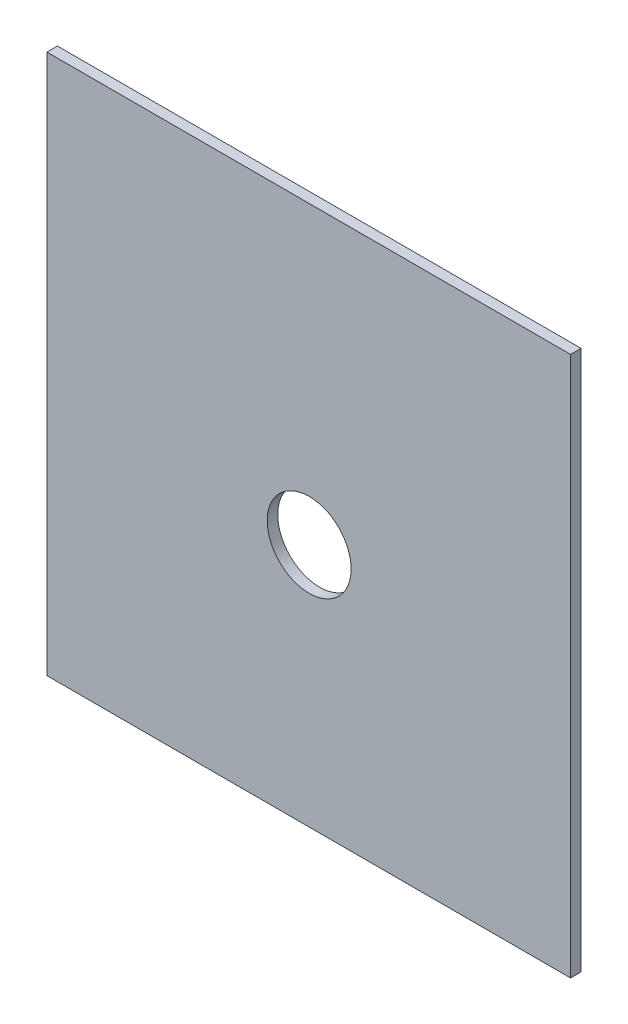
ISO-10303-21;
HEADER;
FILE_DESCRIPTION(('STEP AP214'),'2;1');
FILE_NAME('part.step','',(''),(''),'','','');
FILE_SCHEMA(('AUTOMOTIVE_DESIGN { 1 0 10303 214 1 1 1 1 }'));
ENDSEC;
DATA;
#1=APPLICATION_CONTEXT('core data for automotive mechanical design processes');
#2=APPLICATION_PROTOCOL_DEFINITION('international standard','automotive_design',2000,#1);
#3=PRODUCT_CONTEXT('',#1,'mechanical');
#4=PRODUCT('Part','Part','',(#3));
#5=PRODUCT_RELATED_PRODUCT_CATEGORY('part','',(#4));
#6=PRODUCT_DEFINITION_FORMATION('','',#4);
#7=PRODUCT_DEFINITION_CONTEXT('part definition',#1,'design');
#8=PRODUCT_DEFINITION('design','',#6,#7);
#9=PRODUCT_DEFINITION_SHAPE('','',#8);
#10=(LENGTH_UNIT() NAMED_UNIT(*) SI_UNIT(.MILLI.,.METRE.));
#11=(NAMED_UNIT(*) PLANE_ANGLE_UNIT() SI_UNIT($,.RADIAN.));
#12=(NAMED_UNIT(*) SI_UNIT($,.STERADIAN.) SOLID_ANGLE_UNIT());
#13=UNCERTAINTY_MEASURE_WITH_UNIT(LENGTH_MEASURE(1.E-05),#10,'distance_accuracy_value','');
#14=(GEOMETRIC_REPRESENTATION_CONTEXT(3) GLOBAL_UNCERTAINTY_ASSIGNED_CONTEXT((#13)) GLOBAL_UNIT_ASSIGNED_CONTEXT((#10,
#11,#12)) REPRESENTATION_CONTEXT('',''));
#15=CARTESIAN_POINT('',(0.,0.,0.));
#16=DIRECTION('',(0.,0.,1.));
#17=DIRECTION('',(1.,0.,0.));
#18=AXIS2_PLACEMENT_3D('',#15,#16,#17);
#19=CARTESIAN_POINT('',(0.,0.,5.));
#20=DIRECTION('',(1.,0.,0.));
#21=DIRECTION('',(0.,1.,0.));
#22=AXIS2_PLACEMENT_3D('',#19,#20,#21);
#23=PLANE('',#22);
#24=DIRECTION('',(0.,-1.,0.));
#25=VECTOR('',#24,1.);
#26=CARTESIAN_POINT('',(0.,0.,0.));
#27=LINE('',#26,#25);
#28=CARTESIAN_POINT('',(0.,0.,0.));
#29=VERTEX_POINT('',#28);
#30=CARTESIAN_POINT('',(0.,-257.4,0.));
#31=VERTEX_POINT('',#30);
#32=EDGE_CURVE('E96',#29,#31,#27,.T.);
#33=ORIENTED_EDGE('',*,*,#32,.T.);
#34=DIRECTION('',(0.,0.,-1.));
#35=VECTOR('',#34,1.);
#36=CARTESIAN_POINT('',(0.,-257.4,5.));
#37=LINE('',#36,#35);
#38=CARTESIAN_POINT('',(0.,-257.4,5.));
#39=VERTEX_POINT('',#38);
#40=EDGE_CURVE('E11',#39,#31,#37,.T.);
#41=ORIENTED_EDGE('',*,*,#40,.F.);
#42=DIRECTION('',(0.,-1.,0.));
#43=VECTOR('',#42,1.);
#44=CARTESIAN_POINT('',(0.,0.,5.));
#45=LINE('',#44,#43);
#46=CARTESIAN_POINT('',(0.,0.,5.));
#47=VERTEX_POINT('',#46);
#48=EDGE_CURVE('E84',#47,#39,#45,.T.);
#49=ORIENTED_EDGE('',*,*,#48,.F.);
#50=DIRECTION('',(0.,0.,-1.));
#51=VECTOR('',#50,1.);
#52=CARTESIAN_POINT('',(0.,0.,5.));
#53=LINE('',#52,#51);
#54=EDGE_CURVE('E92',#47,#29,#53,.T.);
#55=ORIENTED_EDGE('',*,*,#54,.T.);
#56=EDGE_LOOP('',(#33,#41,#49,#55));
#57=FACE_BOUND('',#56,.T.);
#58=ADVANCED_FACE('F33',(#57),#23,.F.);
#59=CARTESIAN_POINT('',(0.,-257.4,5.));
#60=DIRECTION('',(0.,1.,0.));
#61=DIRECTION('',(0.,0.,1.));
#62=AXIS2_PLACEMENT_3D('',#59,#60,#61);
#63=PLANE('',#62);
#64=DIRECTION('',(1.,0.,0.));
#65=VECTOR('',#64,1.);
#66=CARTESIAN_POINT('',(0.,-257.4,0.));
#67=LINE('',#66,#65);
#68=CARTESIAN_POINT('',(249.6,-257.4,0.));
#69=VERTEX_POINT('',#68);
#70=EDGE_CURVE('E88',#31,#69,#67,.T.);
#71=ORIENTED_EDGE('',*,*,#70,.T.);
#72=DIRECTION('',(0.,0.,-1.));
#73=VECTOR('',#72,1.);
#74=CARTESIAN_POINT('',(249.6,-257.4,5.));
#75=LINE('',#74,#73);
#76=CARTESIAN_POINT('',(249.6,-257.4,5.));
#77=VERTEX_POINT('',#76);
#78=EDGE_CURVE('E41',#77,#69,#75,.T.);
#79=ORIENTED_EDGE('',*,*,#78,.F.);
#80=DIRECTION('',(1.,0.,0.));
#81=VECTOR('',#80,1.);
#82=CARTESIAN_POINT('',(0.,-257.4,5.));
#83=LINE('',#82,#81);
#84=EDGE_CURVE('E79',#39,#77,#83,.T.);
#85=ORIENTED_EDGE('',*,*,#84,.F.);
#86=ORIENTED_EDGE('',*,*,#40,.T.);
#87=EDGE_LOOP('',(#71,#79,#85,#86));
#88=FACE_BOUND('',#87,.T.);
#89=ADVANCED_FACE('F87',(#88),#63,.F.);
#90=CARTESIAN_POINT('',(249.6,0.,5.));
#91=DIRECTION('',(-1.,0.,0.));
#92=DIRECTION('',(0.,-1.,0.));
#93=AXIS2_PLACEMENT_3D('',#90,#91,#92);
#94=PLANE('',#93);
#95=DIRECTION('',(0.,1.,0.));
#96=VECTOR('',#95,1.);
#97=CARTESIAN_POINT('',(249.6,0.,0.));
#98=LINE('',#97,#96);
#99=CARTESIAN_POINT('',(249.6,0.,0.));
#100=VERTEX_POINT('',#99);
#101=EDGE_CURVE('E66',#69,#100,#98,.T.);
#102=ORIENTED_EDGE('',*,*,#101,.T.);
#103=DIRECTION('',(0.,0.,-1.));
#104=VECTOR('',#103,1.);
#105=CARTESIAN_POINT('',(249.6,0.,5.));
#106=LINE('',#105,#104);
#107=CARTESIAN_POINT('',(249.6,0.,5.));
#108=VERTEX_POINT('',#107);
#109=EDGE_CURVE('E89',#108,#100,#106,.T.);
#110=ORIENTED_EDGE('',*,*,#109,.F.);
#111=DIRECTION('',(0.,1.,0.));
#112=VECTOR('',#111,1.);
#113=CARTESIAN_POINT('',(249.6,0.,5.));
#114=LINE('',#113,#112);
#115=EDGE_CURVE('E82',#77,#108,#114,.T.);
#116=ORIENTED_EDGE('',*,*,#115,.F.);
#117=ORIENTED_EDGE('',*,*,#78,.T.);
#118=EDGE_LOOP('',(#102,#110,#116,#117));
#119=FACE_BOUND('',#118,.T.);
#120=ADVANCED_FACE('F90',(#119),#94,.F.);
#121=CARTESIAN_POINT('',(0.,0.,5.));
#122=DIRECTION('',(0.,-1.,0.));
#123=DIRECTION('',(0.,0.,-1.));
#124=AXIS2_PLACEMENT_3D('',#121,#122,#123);
#125=PLANE('',#124);
#126=DIRECTION('',(-1.,0.,0.));
#127=VECTOR('',#126,1.);
#128=CARTESIAN_POINT('',(0.,0.,0.));
#129=LINE('',#128,#127);
#130=EDGE_CURVE('E72',#100,#29,#129,.T.);
#131=ORIENTED_EDGE('',*,*,#130,.T.);
#132=ORIENTED_EDGE('',*,*,#54,.F.);
#133=DIRECTION('',(-1.,0.,0.));
#134=VECTOR('',#133,1.);
#135=CARTESIAN_POINT('',(0.,0.,5.));
#136=LINE('',#135,#134);
#137=EDGE_CURVE('E49',#108,#47,#136,.T.);
#138=ORIENTED_EDGE('',*,*,#137,.F.);
#139=ORIENTED_EDGE('',*,*,#109,.T.);
#140=EDGE_LOOP('',(#131,#132,#138,#139));
#141=FACE_BOUND('',#140,.T.);
#142=ADVANCED_FACE('F104',(#141),#125,.F.);
#143=CARTESIAN_POINT('',(0.,0.,5.));
#144=DIRECTION('',(0.,0.,1.));
#145=DIRECTION('',(1.,0.,0.));
#146=AXIS2_PLACEMENT_3D('',#143,#144,#145);
#147=PLANE('',#146);
#148=CARTESIAN_POINT('',(125.,-140.910978413468,5.));
#149=DIRECTION('',(0.,0.,1.));
#150=DIRECTION('',(1.,0.,0.));
#151=AXIS2_PLACEMENT_3D('',#148,#149,#150);
#152=CIRCLE('',#151,20.);
#153=CARTESIAN_POINT('',(145.,-140.910978413468,5.));
#154=VERTEX_POINT('',#153);
#155=EDGE_CURVE('E110',#154,#154,#152,.T.);
#156=ORIENTED_EDGE('',*,*,#155,.F.);
#157=EDGE_LOOP('',(#156));
#158=FACE_BOUND('',#157,.T.);
#159=ORIENTED_EDGE('',*,*,#48,.T.);
#160=ORIENTED_EDGE('',*,*,#84,.T.);
#161=ORIENTED_EDGE('',*,*,#115,.T.);
#162=ORIENTED_EDGE('',*,*,#137,.T.);
#163=EDGE_LOOP('',(#159,#160,#161,#162));
#164=FACE_BOUND('',#163,.T.);
#165=ADVANCED_FACE('F80',(#158,#164),#147,.T.);
#166=CARTESIAN_POINT('',(0.,0.,0.));
#167=DIRECTION('',(0.,0.,1.));
#168=DIRECTION('',(1.,0.,0.));
#169=AXIS2_PLACEMENT_3D('',#166,#167,#168);
#170=PLANE('',#169);
#171=CARTESIAN_POINT('',(125.,-140.910978413468,0.));
#172=DIRECTION('',(0.,0.,1.));
#173=DIRECTION('',(1.,0.,0.));
#174=AXIS2_PLACEMENT_3D('',#171,#172,#173);
#175=CIRCLE('',#174,20.);
#176=CARTESIAN_POINT('',(145.,-140.910978413468,0.));
#177=VERTEX_POINT('',#176);
#178=EDGE_CURVE('E99',#177,#177,#175,.T.);
#179=ORIENTED_EDGE('',*,*,#178,.T.);
#180=EDGE_LOOP('',(#179));
#181=FACE_BOUND('',#180,.T.);
#182=ORIENTED_EDGE('',*,*,#32,.F.);
#183=ORIENTED_EDGE('',*,*,#130,.F.);
#184=ORIENTED_EDGE('',*,*,#101,.F.);
#185=ORIENTED_EDGE('',*,*,#70,.F.);
#186=EDGE_LOOP('',(#182,#183,#184,#185));
#187=FACE_BOUND('',#186,.T.);
#188=ADVANCED_FACE('F107',(#181,#187),#170,.F.);
#189=CARTESIAN_POINT('',(125.,-140.910978413468,0.));
#190=DIRECTION('',(0.,0.,1.));
#191=DIRECTION('',(1.,0.,0.));
#192=AXIS2_PLACEMENT_3D('',#189,#190,#191);
#193=CYLINDRICAL_SURFACE('',#192,20.);
#194=ORIENTED_EDGE('',*,*,#178,.F.);
#195=EDGE_LOOP('',(#194));
#196=FACE_BOUND('',#195,.T.);
#197=ORIENTED_EDGE('',*,*,#155,.T.);
#198=EDGE_LOOP('',(#197));
#199=FACE_BOUND('',#198,.T.);
#200=ADVANCED_FACE('F117',(#196,#199),#193,.F.);
#201=CLOSED_SHELL('',(#58,#89,#120,#142,#165,#188,#200));
#202=MANIFOLD_SOLID_BREP('B2',#201);
#203=ADVANCED_BREP_SHAPE_REPRESENTATION('',(#18,#202),#14);
#204=SHAPE_DEFINITION_REPRESENTATION(#9,#203);
ENDSEC;
END-ISO-10303-21;
